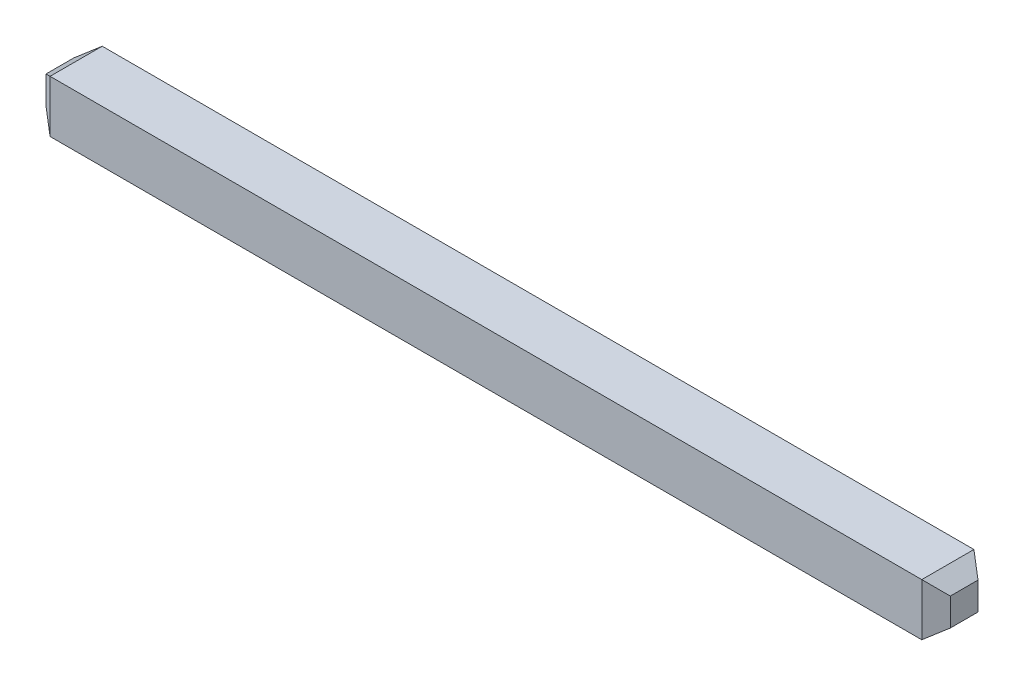
ISO-10303-21;
HEADER;
FILE_DESCRIPTION(('STEP AP214'),'2;1');
FILE_NAME('part.step','',(''),(''),'','','');
FILE_SCHEMA(('AUTOMOTIVE_DESIGN { 1 0 10303 214 1 1 1 1 }'));
ENDSEC;
DATA;
#1=APPLICATION_CONTEXT('core data for automotive mechanical design processes');
#2=APPLICATION_PROTOCOL_DEFINITION('international standard','automotive_design',2000,#1);
#3=PRODUCT_CONTEXT('',#1,'mechanical');
#4=PRODUCT('Part','Part','',(#3));
#5=PRODUCT_RELATED_PRODUCT_CATEGORY('part','',(#4));
#6=PRODUCT_DEFINITION_FORMATION('','',#4);
#7=PRODUCT_DEFINITION_CONTEXT('part definition',#1,'design');
#8=PRODUCT_DEFINITION('design','',#6,#7);
#9=PRODUCT_DEFINITION_SHAPE('','',#8);
#10=(LENGTH_UNIT() NAMED_UNIT(*) SI_UNIT(.MILLI.,.METRE.));
#11=(NAMED_UNIT(*) PLANE_ANGLE_UNIT() SI_UNIT($,.RADIAN.));
#12=(NAMED_UNIT(*) SI_UNIT($,.STERADIAN.) SOLID_ANGLE_UNIT());
#13=UNCERTAINTY_MEASURE_WITH_UNIT(LENGTH_MEASURE(1.E-05),#10,'distance_accuracy_value','');
#14=(GEOMETRIC_REPRESENTATION_CONTEXT(3) GLOBAL_UNCERTAINTY_ASSIGNED_CONTEXT((#13)) GLOBAL_UNIT_ASSIGNED_CONTEXT((#10,
#11,#12)) REPRESENTATION_CONTEXT('',''));
#15=CARTESIAN_POINT('',(0.,0.,0.));
#16=DIRECTION('',(0.,0.,1.));
#17=DIRECTION('',(1.,0.,0.));
#18=AXIS2_PLACEMENT_3D('',#15,#16,#17);
#19=CARTESIAN_POINT('',(-2.4,1.23,-14.215));
#20=DIRECTION('',(0.599999999990736,0.,0.800000000006948));
#21=DIRECTION('',(0.800000000006948,0.,-0.599999999990736));
#22=AXIS2_PLACEMENT_3D('',#19,#20,#21);
#23=PLANE('',#22);
#24=DIRECTION('',(0.,1.,0.));
#25=VECTOR('',#24,1.);
#26=CARTESIAN_POINT('',(-2.3,1.23,-14.29));
#27=LINE('',#26,#25);
#28=CARTESIAN_POINT('',(-2.29999999999957,1.55,-14.2899999999994));
#29=VERTEX_POINT('',#28);
#30=CARTESIAN_POINT('',(-2.29999999999958,0.909999999999898,-14.2899999999994));
#31=VERTEX_POINT('',#30);
#32=EDGE_CURVE('E101',#29,#31,#27,.F.);
#33=ORIENTED_EDGE('',*,*,#32,.T.);
#34=DIRECTION('',(-0.685994340569495,0.514495755428344,0.514495755427429));
#35=VECTOR('',#34,1.);
#36=CARTESIAN_POINT('',(-2.30000000000009,0.909999999999786,-14.29));
#37=LINE('',#36,#35);
#38=CARTESIAN_POINT('',(-2.50000000000021,1.06000000000001,-14.1400000000003));
#39=VERTEX_POINT('',#38);
#40=EDGE_CURVE('E85',#31,#39,#37,.T.);
#41=ORIENTED_EDGE('',*,*,#40,.T.);
#42=DIRECTION('',(0.,1.,0.));
#43=VECTOR('',#42,1.);
#44=CARTESIAN_POINT('',(-2.5,1.23,-14.14));
#45=LINE('',#44,#43);
#46=CARTESIAN_POINT('',(-2.50000000000043,1.4,-14.1400000000006));
#47=VERTEX_POINT('',#46);
#48=EDGE_CURVE('E79',#39,#47,#45,.T.);
#49=ORIENTED_EDGE('',*,*,#48,.T.);
#50=DIRECTION('',(-0.685994340570038,-0.514495755427529,0.51449575542752));
#51=VECTOR('',#50,1.);
#52=CARTESIAN_POINT('',(-2.3,1.55,-14.29));
#53=LINE('',#52,#51);
#54=EDGE_CURVE('E20',#29,#47,#53,.T.);
#55=ORIENTED_EDGE('',*,*,#54,.F.);
#56=EDGE_LOOP('',(#33,#41,#49,#55));
#57=FACE_BOUND('',#56,.T.);
#58=ADVANCED_FACE('F17',(#57),#23,.F.);
#59=CARTESIAN_POINT('',(8.5,1.23,-14.215));
#60=DIRECTION('',(-0.599999999990736,0.,0.800000000006948));
#61=DIRECTION('',(0.800000000006948,0.,0.599999999990736));
#62=AXIS2_PLACEMENT_3D('',#59,#60,#61);
#63=PLANE('',#62);
#64=DIRECTION('',(0.,1.,0.));
#65=VECTOR('',#64,1.);
#66=CARTESIAN_POINT('',(8.6,1.23,-14.14));
#67=LINE('',#66,#65);
#68=CARTESIAN_POINT('',(8.6000000000002,1.06000000000003,-14.1400000000003));
#69=VERTEX_POINT('',#68);
#70=CARTESIAN_POINT('',(8.60000000000043,1.4,-14.1400000000006));
#71=VERTEX_POINT('',#70);
#72=EDGE_CURVE('E113',#69,#71,#67,.T.);
#73=ORIENTED_EDGE('',*,*,#72,.F.);
#74=DIRECTION('',(-0.685994340569496,-0.514495755428343,-0.514495755427429));
#75=VECTOR('',#74,1.);
#76=CARTESIAN_POINT('',(8.59999999999996,1.06000000000005,-14.14));
#77=LINE('',#76,#75);
#78=CARTESIAN_POINT('',(8.39999999999959,0.909999999999884,-14.2899999999994));
#79=VERTEX_POINT('',#78);
#80=EDGE_CURVE('E108',#69,#79,#77,.T.);
#81=ORIENTED_EDGE('',*,*,#80,.T.);
#82=DIRECTION('',(0.,1.,0.));
#83=VECTOR('',#82,1.);
#84=CARTESIAN_POINT('',(8.4,1.23,-14.29));
#85=LINE('',#84,#83);
#86=CARTESIAN_POINT('',(8.39999999999957,1.55,-14.2899999999994));
#87=VERTEX_POINT('',#86);
#88=EDGE_CURVE('E99',#79,#87,#85,.T.);
#89=ORIENTED_EDGE('',*,*,#88,.T.);
#90=DIRECTION('',(-0.685994340570037,0.514495755427528,-0.514495755427522));
#91=VECTOR('',#90,1.);
#92=CARTESIAN_POINT('',(8.6,1.4,-14.14));
#93=LINE('',#92,#91);
#94=EDGE_CURVE('E116',#71,#87,#93,.T.);
#95=ORIENTED_EDGE('',*,*,#94,.F.);
#96=EDGE_LOOP('',(#73,#81,#89,#95));
#97=FACE_BOUND('',#96,.T.);
#98=ADVANCED_FACE('F214',(#97),#63,.F.);
#99=CARTESIAN_POINT('',(-2.4,1.475,-13.97));
#100=DIRECTION('',(-0.6,0.8,0.));
#101=DIRECTION('',(-0.8,-0.6,0.));
#102=AXIS2_PLACEMENT_3D('',#99,#100,#101);
#103=PLANE('',#102);
#104=DIRECTION('',(-0.685994340575993,-0.514495755427526,-0.514495755419585));
#105=VECTOR('',#104,1.);
#106=CARTESIAN_POINT('',(-2.29999999999913,1.55,-13.6500000000012));
#107=LINE('',#106,#105);
#108=CARTESIAN_POINT('',(-2.29999999999989,1.55,-13.6500000000001));
#109=VERTEX_POINT('',#108);
#110=CARTESIAN_POINT('',(-2.50000000000022,1.4,-13.7999999999997));
#111=VERTEX_POINT('',#110);
#112=EDGE_CURVE('E128',#109,#111,#107,.T.);
#113=ORIENTED_EDGE('',*,*,#112,.F.);
#114=DIRECTION('',(0.,0.,1.));
#115=VECTOR('',#114,1.);
#116=CARTESIAN_POINT('',(-2.3,1.55,-13.97));
#117=LINE('',#116,#115);
#118=EDGE_CURVE('E93',#29,#109,#117,.T.);
#119=ORIENTED_EDGE('',*,*,#118,.F.);
#120=ORIENTED_EDGE('',*,*,#54,.T.);
#121=DIRECTION('',(0.,0.,-1.));
#122=VECTOR('',#121,1.);
#123=CARTESIAN_POINT('',(-2.5,1.4,-13.97));
#124=LINE('',#123,#122);
#125=EDGE_CURVE('E87',#47,#111,#124,.F.);
#126=ORIENTED_EDGE('',*,*,#125,.T.);
#127=EDGE_LOOP('',(#113,#119,#120,#126));
#128=FACE_BOUND('',#127,.T.);
#129=ADVANCED_FACE('F90',(#128),#103,.T.);
#130=CARTESIAN_POINT('',(-2.5,1.23,-13.97));
#131=DIRECTION('',(1.,0.,0.));
#132=DIRECTION('',(0.,0.,-1.));
#133=AXIS2_PLACEMENT_3D('',#130,#131,#132);
#134=PLANE('',#133);
#135=DIRECTION('',(0.,1.,0.));
#136=VECTOR('',#135,1.);
#137=CARTESIAN_POINT('',(-2.50000000000087,1.23,-13.7999999999988));
#138=LINE('',#137,#136);
#139=CARTESIAN_POINT('',(-2.50000000000021,1.06000000000001,-13.7999999999997));
#140=VERTEX_POINT('',#139);
#141=EDGE_CURVE('E97',#111,#140,#138,.F.);
#142=ORIENTED_EDGE('',*,*,#141,.F.);
#143=ORIENTED_EDGE('',*,*,#125,.F.);
#144=ORIENTED_EDGE('',*,*,#48,.F.);
#145=DIRECTION('',(0.,0.,1.));
#146=VECTOR('',#145,1.);
#147=CARTESIAN_POINT('',(-2.49999999999996,1.06000000000005,-13.97));
#148=LINE('',#147,#146);
#149=EDGE_CURVE('E105',#39,#140,#148,.T.);
#150=ORIENTED_EDGE('',*,*,#149,.T.);
#151=EDGE_LOOP('',(#142,#143,#144,#150));
#152=FACE_BOUND('',#151,.T.);
#153=ADVANCED_FACE('F95',(#152),#134,.F.);
#154=CARTESIAN_POINT('',(3.05,1.23,-14.29));
#155=DIRECTION('',(0.,0.,1.));
#156=DIRECTION('',(1.,0.,0.));
#157=AXIS2_PLACEMENT_3D('',#154,#155,#156);
#158=PLANE('',#157);
#159=ORIENTED_EDGE('',*,*,#32,.F.);
#160=DIRECTION('',(1.,0.,0.));
#161=VECTOR('',#160,1.);
#162=CARTESIAN_POINT('',(3.05,1.55,-14.29));
#163=LINE('',#162,#161);
#164=EDGE_CURVE('E122',#87,#29,#163,.F.);
#165=ORIENTED_EDGE('',*,*,#164,.F.);
#166=ORIENTED_EDGE('',*,*,#88,.F.);
#167=DIRECTION('',(1.,0.,0.));
#168=VECTOR('',#167,1.);
#169=CARTESIAN_POINT('',(3.05,0.91,-14.29));
#170=LINE('',#169,#168);
#171=EDGE_CURVE('E136',#79,#31,#170,.F.);
#172=ORIENTED_EDGE('',*,*,#171,.T.);
#173=EDGE_LOOP('',(#159,#165,#166,#172));
#174=FACE_BOUND('',#173,.T.);
#175=ADVANCED_FACE('F182',(#174),#158,.F.);
#176=CARTESIAN_POINT('',(-2.4,0.9849999999999,-13.97));
#177=DIRECTION('',(0.600000000000912,0.799999999999316,0.));
#178=DIRECTION('',(-0.799999999999316,0.600000000000912,0.));
#179=AXIS2_PLACEMENT_3D('',#176,#177,#178);
#180=PLANE('',#179);
#181=DIRECTION('',(0.,0.,1.));
#182=VECTOR('',#181,1.);
#183=CARTESIAN_POINT('',(-2.3,0.91,-13.97));
#184=LINE('',#183,#182);
#185=CARTESIAN_POINT('',(-2.29999999999983,0.909999999999856,-13.6500000000003));
#186=VERTEX_POINT('',#185);
#187=EDGE_CURVE('E139',#31,#186,#184,.T.);
#188=ORIENTED_EDGE('',*,*,#187,.T.);
#189=DIRECTION('',(0.685994340575871,-0.514495755427778,0.514495755419494));
#190=VECTOR('',#189,1.);
#191=CARTESIAN_POINT('',(-2.50000000000087,1.06,-13.7999999999988));
#192=LINE('',#191,#190);
#193=EDGE_CURVE('E131',#140,#186,#192,.T.);
#194=ORIENTED_EDGE('',*,*,#193,.F.);
#195=ORIENTED_EDGE('',*,*,#149,.F.);
#196=ORIENTED_EDGE('',*,*,#40,.F.);
#197=EDGE_LOOP('',(#188,#194,#195,#196));
#198=FACE_BOUND('',#197,.T.);
#199=ADVANCED_FACE('F179',(#198),#180,.F.);
#200=CARTESIAN_POINT('',(8.5,0.9849999999999,-13.97));
#201=DIRECTION('',(-0.600000000000912,0.799999999999316,0.));
#202=DIRECTION('',(-0.799999999999316,-0.600000000000912,0.));
#203=AXIS2_PLACEMENT_3D('',#200,#201,#202);
#204=PLANE('',#203);
#205=DIRECTION('',(0.,0.,-1.));
#206=VECTOR('',#205,1.);
#207=CARTESIAN_POINT('',(8.6,1.06,-13.97));
#208=LINE('',#207,#206);
#209=CARTESIAN_POINT('',(8.6000000000002,1.06000000000003,-13.7999999999997));
#210=VERTEX_POINT('',#209);
#211=EDGE_CURVE('E110',#210,#69,#208,.T.);
#212=ORIENTED_EDGE('',*,*,#211,.F.);
#213=DIRECTION('',(0.68599434057587,0.514495755427782,-0.514495755419492));
#214=VECTOR('',#213,1.);
#215=CARTESIAN_POINT('',(8.39999999999913,0.9099999999999,-13.6500000000012));
#216=LINE('',#215,#214);
#217=CARTESIAN_POINT('',(8.39999999999993,0.909999999999868,-13.6500000000001));
#218=VERTEX_POINT('',#217);
#219=EDGE_CURVE('E35',#218,#210,#216,.T.);
#220=ORIENTED_EDGE('',*,*,#219,.F.);
#221=DIRECTION('',(0.,0.,1.));
#222=VECTOR('',#221,1.);
#223=CARTESIAN_POINT('',(8.4,0.91,-13.97));
#224=LINE('',#223,#222);
#225=EDGE_CURVE('E134',#218,#79,#224,.F.);
#226=ORIENTED_EDGE('',*,*,#225,.T.);
#227=ORIENTED_EDGE('',*,*,#80,.F.);
#228=EDGE_LOOP('',(#212,#220,#226,#227));
#229=FACE_BOUND('',#228,.T.);
#230=ADVANCED_FACE('F181',(#229),#204,.F.);
#231=CARTESIAN_POINT('',(8.6,1.23,-13.97));
#232=DIRECTION('',(1.,0.,0.));
#233=DIRECTION('',(0.,0.,-1.));
#234=AXIS2_PLACEMENT_3D('',#231,#232,#233);
#235=PLANE('',#234);
#236=ORIENTED_EDGE('',*,*,#72,.T.);
#237=DIRECTION('',(0.,0.,1.));
#238=VECTOR('',#237,1.);
#239=CARTESIAN_POINT('',(8.6,1.4,-13.97));
#240=LINE('',#239,#238);
#241=CARTESIAN_POINT('',(8.60000000000022,1.4,-13.7999999999997));
#242=VERTEX_POINT('',#241);
#243=EDGE_CURVE('E119',#242,#71,#240,.F.);
#244=ORIENTED_EDGE('',*,*,#243,.F.);
#245=DIRECTION('',(0.,1.,0.));
#246=VECTOR('',#245,1.);
#247=CARTESIAN_POINT('',(8.60000000000087,1.23,-13.7999999999988));
#248=LINE('',#247,#246);
#249=EDGE_CURVE('E142',#210,#242,#248,.T.);
#250=ORIENTED_EDGE('',*,*,#249,.F.);
#251=ORIENTED_EDGE('',*,*,#211,.T.);
#252=EDGE_LOOP('',(#236,#244,#250,#251));
#253=FACE_BOUND('',#252,.T.);
#254=ADVANCED_FACE('F189',(#253),#235,.T.);
#255=CARTESIAN_POINT('',(8.5,1.475,-13.97));
#256=DIRECTION('',(0.6,0.8,0.));
#257=DIRECTION('',(-0.8,0.6,0.));
#258=AXIS2_PLACEMENT_3D('',#255,#256,#257);
#259=PLANE('',#258);
#260=DIRECTION('',(-0.685994340575991,0.51449575542753,0.514495755419583));
#261=VECTOR('',#260,1.);
#262=CARTESIAN_POINT('',(8.60000000000087,1.4,-13.7999999999988));
#263=LINE('',#262,#261);
#264=CARTESIAN_POINT('',(8.39999999999989,1.55,-13.6500000000001));
#265=VERTEX_POINT('',#264);
#266=EDGE_CURVE('E145',#242,#265,#263,.T.);
#267=ORIENTED_EDGE('',*,*,#266,.F.);
#268=ORIENTED_EDGE('',*,*,#243,.T.);
#269=ORIENTED_EDGE('',*,*,#94,.T.);
#270=DIRECTION('',(0.,0.,1.));
#271=VECTOR('',#270,1.);
#272=CARTESIAN_POINT('',(8.4,1.55,-13.97));
#273=LINE('',#272,#271);
#274=EDGE_CURVE('E125',#265,#87,#273,.F.);
#275=ORIENTED_EDGE('',*,*,#274,.F.);
#276=EDGE_LOOP('',(#267,#268,#269,#275));
#277=FACE_BOUND('',#276,.T.);
#278=ADVANCED_FACE('F170',(#277),#259,.T.);
#279=CARTESIAN_POINT('',(3.05,1.55,-13.97));
#280=DIRECTION('',(0.,1.,0.));
#281=DIRECTION('',(0.,0.,1.));
#282=AXIS2_PLACEMENT_3D('',#279,#280,#281);
#283=PLANE('',#282);
#284=DIRECTION('',(1.,0.,0.));
#285=VECTOR('',#284,1.);
#286=CARTESIAN_POINT('',(3.05,1.55,-13.65));
#287=LINE('',#286,#285);
#288=EDGE_CURVE('E148',#265,#109,#287,.F.);
#289=ORIENTED_EDGE('',*,*,#288,.F.);
#290=ORIENTED_EDGE('',*,*,#274,.T.);
#291=ORIENTED_EDGE('',*,*,#164,.T.);
#292=ORIENTED_EDGE('',*,*,#118,.T.);
#293=EDGE_LOOP('',(#289,#290,#291,#292));
#294=FACE_BOUND('',#293,.T.);
#295=ADVANCED_FACE('F173',(#294),#283,.T.);
#296=CARTESIAN_POINT('',(-2.4,1.23,-13.725));
#297=DIRECTION('',(-0.599999999990736,0.,0.800000000006948));
#298=DIRECTION('',(0.800000000006948,0.,0.599999999990736));
#299=AXIS2_PLACEMENT_3D('',#296,#297,#298);
#300=PLANE('',#299);
#301=ORIENTED_EDGE('',*,*,#193,.T.);
#302=DIRECTION('',(0.,1.,0.));
#303=VECTOR('',#302,1.);
#304=CARTESIAN_POINT('',(-2.3,1.23,-13.65));
#305=LINE('',#304,#303);
#306=EDGE_CURVE('E151',#109,#186,#305,.F.);
#307=ORIENTED_EDGE('',*,*,#306,.F.);
#308=ORIENTED_EDGE('',*,*,#112,.T.);
#309=ORIENTED_EDGE('',*,*,#141,.T.);
#310=EDGE_LOOP('',(#301,#307,#308,#309));
#311=FACE_BOUND('',#310,.T.);
#312=ADVANCED_FACE('F176',(#311),#300,.T.);
#313=CARTESIAN_POINT('',(3.05,0.91,-13.97));
#314=DIRECTION('',(0.,1.,0.));
#315=DIRECTION('',(0.,0.,1.));
#316=AXIS2_PLACEMENT_3D('',#313,#314,#315);
#317=PLANE('',#316);
#318=ORIENTED_EDGE('',*,*,#187,.F.);
#319=ORIENTED_EDGE('',*,*,#171,.F.);
#320=ORIENTED_EDGE('',*,*,#225,.F.);
#321=DIRECTION('',(1.,0.,0.));
#322=VECTOR('',#321,1.);
#323=CARTESIAN_POINT('',(3.05,0.9099999999999,-13.65));
#324=LINE('',#323,#322);
#325=EDGE_CURVE('E26',#186,#218,#324,.T.);
#326=ORIENTED_EDGE('',*,*,#325,.F.);
#327=EDGE_LOOP('',(#318,#319,#320,#326));
#328=FACE_BOUND('',#327,.T.);
#329=ADVANCED_FACE('F162',(#328),#317,.F.);
#330=CARTESIAN_POINT('',(8.5,1.23,-13.725));
#331=DIRECTION('',(0.599999999990736,0.,0.800000000006948));
#332=DIRECTION('',(0.800000000006948,0.,-0.599999999990736));
#333=AXIS2_PLACEMENT_3D('',#330,#331,#332);
#334=PLANE('',#333);
#335=ORIENTED_EDGE('',*,*,#266,.T.);
#336=DIRECTION('',(0.,1.,0.));
#337=VECTOR('',#336,1.);
#338=CARTESIAN_POINT('',(8.4,1.23,-13.65));
#339=LINE('',#338,#337);
#340=EDGE_CURVE('E11',#218,#265,#339,.T.);
#341=ORIENTED_EDGE('',*,*,#340,.F.);
#342=ORIENTED_EDGE('',*,*,#219,.T.);
#343=ORIENTED_EDGE('',*,*,#249,.T.);
#344=EDGE_LOOP('',(#335,#341,#342,#343));
#345=FACE_BOUND('',#344,.T.);
#346=ADVANCED_FACE('F166',(#345),#334,.T.);
#347=CARTESIAN_POINT('',(3.05,1.23,-13.65));
#348=DIRECTION('',(0.,0.,1.));
#349=DIRECTION('',(1.,0.,0.));
#350=AXIS2_PLACEMENT_3D('',#347,#348,#349);
#351=PLANE('',#350);
#352=ORIENTED_EDGE('',*,*,#325,.T.);
#353=ORIENTED_EDGE('',*,*,#340,.T.);
#354=ORIENTED_EDGE('',*,*,#288,.T.);
#355=ORIENTED_EDGE('',*,*,#306,.T.);
#356=EDGE_LOOP('',(#352,#353,#354,#355));
#357=FACE_BOUND('',#356,.T.);
#358=ADVANCED_FACE('F157',(#357),#351,.T.);
#359=CLOSED_SHELL('',(#58,#98,#129,#153,#175,#199,#230,#254,#278,#295,#312,#329,#346,#358));
#360=MANIFOLD_SOLID_BREP('B1',#359);
#361=ADVANCED_BREP_SHAPE_REPRESENTATION('',(#18,#360),#14);
#362=SHAPE_DEFINITION_REPRESENTATION(#9,#361);
ENDSEC;
END-ISO-10303-21;
